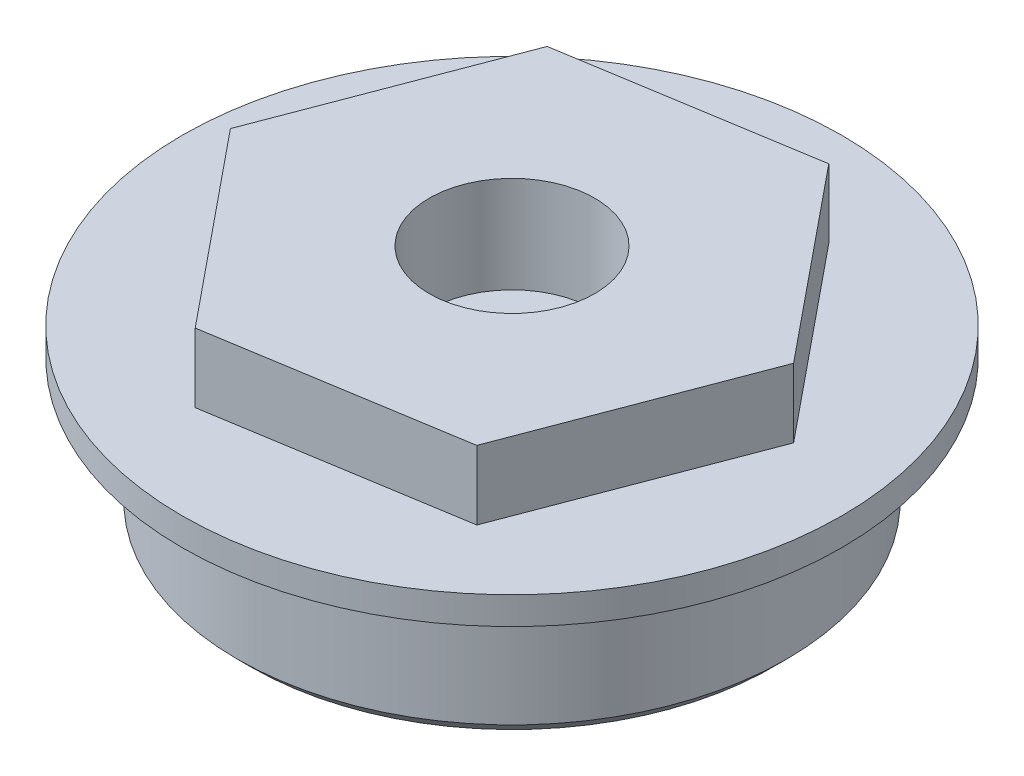
ISO-10303-21;
HEADER;
FILE_DESCRIPTION(('STEP AP214'),'2;1');
FILE_NAME('part.step','',(''),(''),'','','');
FILE_SCHEMA(('AUTOMOTIVE_DESIGN { 1 0 10303 214 1 1 1 1 }'));
ENDSEC;
DATA;
#1=APPLICATION_CONTEXT('core data for automotive mechanical design processes');
#2=APPLICATION_PROTOCOL_DEFINITION('international standard','automotive_design',2000,#1);
#3=PRODUCT_CONTEXT('',#1,'mechanical');
#4=PRODUCT('Part','Part','',(#3));
#5=PRODUCT_RELATED_PRODUCT_CATEGORY('part','',(#4));
#6=PRODUCT_DEFINITION_FORMATION('','',#4);
#7=PRODUCT_DEFINITION_CONTEXT('part definition',#1,'design');
#8=PRODUCT_DEFINITION('design','',#6,#7);
#9=PRODUCT_DEFINITION_SHAPE('','',#8);
#10=(LENGTH_UNIT() NAMED_UNIT(*) SI_UNIT(.MILLI.,.METRE.));
#11=(NAMED_UNIT(*) PLANE_ANGLE_UNIT() SI_UNIT($,.RADIAN.));
#12=(NAMED_UNIT(*) SI_UNIT($,.STERADIAN.) SOLID_ANGLE_UNIT());
#13=UNCERTAINTY_MEASURE_WITH_UNIT(LENGTH_MEASURE(1.E-05),#10,'distance_accuracy_value','');
#14=(GEOMETRIC_REPRESENTATION_CONTEXT(3) GLOBAL_UNCERTAINTY_ASSIGNED_CONTEXT((#13)) GLOBAL_UNIT_ASSIGNED_CONTEXT((#10,
#11,#12)) REPRESENTATION_CONTEXT('',''));
#15=CARTESIAN_POINT('',(0.,0.,0.));
#16=DIRECTION('',(0.,0.,1.));
#17=DIRECTION('',(1.,0.,0.));
#18=AXIS2_PLACEMENT_3D('',#15,#16,#17);
#19=CARTESIAN_POINT('',(0.,8.5,0.));
#20=DIRECTION('',(0.,-1.,0.));
#21=DIRECTION('',(0.,0.,-1.));
#22=AXIS2_PLACEMENT_3D('',#19,#20,#21);
#23=CYLINDRICAL_SURFACE('',#22,1.75);
#24=CARTESIAN_POINT('',(0.,0.,0.));
#25=DIRECTION('',(0.,-1.,0.));
#26=DIRECTION('',(0.,0.,-1.));
#27=AXIS2_PLACEMENT_3D('',#24,#25,#26);
#28=CIRCLE('',#27,1.75);
#29=CARTESIAN_POINT('',(0.,0.,-1.75));
#30=VERTEX_POINT('',#29);
#31=EDGE_CURVE('E143',#30,#30,#28,.T.);
#32=ORIENTED_EDGE('',*,*,#31,.T.);
#33=EDGE_LOOP('',(#32));
#34=FACE_BOUND('',#33,.T.);
#35=CARTESIAN_POINT('',(0.,5.,0.));
#36=DIRECTION('',(0.,1.,0.));
#37=DIRECTION('',(0.,0.,1.));
#38=AXIS2_PLACEMENT_3D('',#35,#36,#37);
#39=CIRCLE('',#38,1.75);
#40=CARTESIAN_POINT('',(0.,5.,1.75));
#41=VERTEX_POINT('',#40);
#42=EDGE_CURVE('E141',#41,#41,#39,.F.);
#43=ORIENTED_EDGE('',*,*,#42,.F.);
#44=EDGE_LOOP('',(#43));
#45=FACE_BOUND('',#44,.T.);
#46=ADVANCED_FACE('F33',(#34,#45),#23,.F.);
#47=CARTESIAN_POINT('',(0.,6.,0.));
#48=DIRECTION('',(0.,1.,0.));
#49=DIRECTION('',(0.,0.,1.));
#50=AXIS2_PLACEMENT_3D('',#47,#48,#49);
#51=PLANE('',#50);
#52=DIRECTION('',(0.987180170449395,0.,-0.159609871472608));
#53=VECTOR('',#52,1.);
#54=CARTESIAN_POINT('',(-3.16273854832839,6.,8.31907956897382));
#55=LINE('',#54,#53);
#56=CARTESIAN_POINT('',(-3.16273854832839,6.,8.31907956897382));
#57=VERTEX_POINT('',#56);
#58=CARTESIAN_POINT('',(5.62316496867123,6.,6.89855171286761));
#59=VERTEX_POINT('',#58);
#60=EDGE_CURVE('E120',#57,#59,#55,.T.);
#61=ORIENTED_EDGE('',*,*,#60,.F.);
#62=DIRECTION('',(0.631816288614745,0.,0.775118169985125));
#63=VECTOR('',#62,1.);
#64=CARTESIAN_POINT('',(-8.78590351699962,6.,1.42052785610621));
#65=LINE('',#64,#63);
#66=CARTESIAN_POINT('',(-8.78590351699962,6.,1.42052785610621));
#67=VERTEX_POINT('',#66);
#68=EDGE_CURVE('E117',#67,#57,#65,.T.);
#69=ORIENTED_EDGE('',*,*,#68,.F.);
#70=DIRECTION('',(-0.35536388183465,0.,0.934728041457733));
#71=VECTOR('',#70,1.);
#72=CARTESIAN_POINT('',(-5.62316496867124,6.,-6.89855171286761));
#73=LINE('',#72,#71);
#74=CARTESIAN_POINT('',(-5.62316496867124,6.,-6.89855171286761));
#75=VERTEX_POINT('',#74);
#76=EDGE_CURVE('E76',#75,#67,#73,.T.);
#77=ORIENTED_EDGE('',*,*,#76,.F.);
#78=DIRECTION('',(-0.987180170449395,0.,0.159609871472608));
#79=VECTOR('',#78,1.);
#80=CARTESIAN_POINT('',(3.16273854832838,6.,-8.31907956897382));
#81=LINE('',#80,#79);
#82=CARTESIAN_POINT('',(3.16273854832838,6.,-8.31907956897382));
#83=VERTEX_POINT('',#82);
#84=EDGE_CURVE('E126',#83,#75,#81,.T.);
#85=ORIENTED_EDGE('',*,*,#84,.F.);
#86=DIRECTION('',(-0.631816288614745,0.,-0.775118169985125));
#87=VECTOR('',#86,1.);
#88=CARTESIAN_POINT('',(8.78590351699962,6.,-1.42052785610621));
#89=LINE('',#88,#87);
#90=CARTESIAN_POINT('',(8.78590351699962,6.,-1.42052785610621));
#91=VERTEX_POINT('',#90);
#92=EDGE_CURVE('E106',#91,#83,#89,.T.);
#93=ORIENTED_EDGE('',*,*,#92,.F.);
#94=DIRECTION('',(0.35536388183465,0.,-0.934728041457733));
#95=VECTOR('',#94,1.);
#96=CARTESIAN_POINT('',(5.62316496867123,6.,6.89855171286761));
#97=LINE('',#96,#95);
#98=EDGE_CURVE('E123',#59,#91,#97,.T.);
#99=ORIENTED_EDGE('',*,*,#98,.F.);
#100=EDGE_LOOP('',(#61,#69,#77,#85,#93,#99));
#101=FACE_BOUND('',#100,.T.);
#102=CARTESIAN_POINT('',(0.,6.,0.));
#103=DIRECTION('',(0.,1.,0.));
#104=DIRECTION('',(0.,0.,1.));
#105=AXIS2_PLACEMENT_3D('',#102,#103,#104);
#106=CIRCLE('',#105,11.95);
#107=CARTESIAN_POINT('',(0.,6.,11.95));
#108=VERTEX_POINT('',#107);
#109=EDGE_CURVE('E416',#108,#108,#106,.T.);
#110=ORIENTED_EDGE('',*,*,#109,.T.);
#111=EDGE_LOOP('',(#110));
#112=FACE_BOUND('',#111,.T.);
#113=ADVANCED_FACE('F162',(#101,#112),#51,.T.);
#114=CARTESIAN_POINT('',(-8.78590351699962,8.5,1.42052785610621));
#115=DIRECTION('',(0.775118169985125,0.,-0.631816288614745));
#116=DIRECTION('',(-0.631816288614745,0.,-0.775118169985125));
#117=AXIS2_PLACEMENT_3D('',#114,#115,#116);
#118=PLANE('',#117);
#119=ORIENTED_EDGE('',*,*,#68,.T.);
#120=DIRECTION('',(0.,-1.,0.));
#121=VECTOR('',#120,1.);
#122=CARTESIAN_POINT('',(-3.16273854832839,8.5,8.31907956897382));
#123=LINE('',#122,#121);
#124=CARTESIAN_POINT('',(-3.16273854832839,8.5,8.31907956897382));
#125=VERTEX_POINT('',#124);
#126=EDGE_CURVE('E136',#125,#57,#123,.T.);
#127=ORIENTED_EDGE('',*,*,#126,.F.);
#128=DIRECTION('',(0.631816288614745,0.,0.775118169985125));
#129=VECTOR('',#128,1.);
#130=CARTESIAN_POINT('',(-8.78590351699962,8.5,1.42052785610621));
#131=LINE('',#130,#129);
#132=CARTESIAN_POINT('',(-8.78590351699962,8.5,1.42052785610621));
#133=VERTEX_POINT('',#132);
#134=EDGE_CURVE('E129',#133,#125,#131,.T.);
#135=ORIENTED_EDGE('',*,*,#134,.F.);
#136=DIRECTION('',(0.,-1.,0.));
#137=VECTOR('',#136,1.);
#138=CARTESIAN_POINT('',(-8.78590351699962,8.5,1.42052785610621));
#139=LINE('',#138,#137);
#140=EDGE_CURVE('E113',#133,#67,#139,.T.);
#141=ORIENTED_EDGE('',*,*,#140,.T.);
#142=EDGE_LOOP('',(#119,#127,#135,#141));
#143=FACE_BOUND('',#142,.T.);
#144=ADVANCED_FACE('F168',(#143),#118,.F.);
#145=CARTESIAN_POINT('',(-3.16273854832839,8.5,8.31907956897382));
#146=DIRECTION('',(-0.159609871472608,0.,-0.987180170449396));
#147=DIRECTION('',(-0.987180170449396,0.,0.159609871472608));
#148=AXIS2_PLACEMENT_3D('',#145,#146,#147);
#149=PLANE('',#148);
#150=ORIENTED_EDGE('',*,*,#60,.T.);
#151=DIRECTION('',(0.,-1.,0.));
#152=VECTOR('',#151,1.);
#153=CARTESIAN_POINT('',(5.62316496867123,8.5,6.89855171286761));
#154=LINE('',#153,#152);
#155=CARTESIAN_POINT('',(5.62316496867123,8.5,6.89855171286761));
#156=VERTEX_POINT('',#155);
#157=EDGE_CURVE('E133',#156,#59,#154,.T.);
#158=ORIENTED_EDGE('',*,*,#157,.F.);
#159=DIRECTION('',(0.987180170449395,0.,-0.159609871472608));
#160=VECTOR('',#159,1.);
#161=CARTESIAN_POINT('',(-3.16273854832839,8.5,8.31907956897382));
#162=LINE('',#161,#160);
#163=EDGE_CURVE('E84',#125,#156,#162,.T.);
#164=ORIENTED_EDGE('',*,*,#163,.F.);
#165=ORIENTED_EDGE('',*,*,#126,.T.);
#166=EDGE_LOOP('',(#150,#158,#164,#165));
#167=FACE_BOUND('',#166,.T.);
#168=ADVANCED_FACE('F229',(#167),#149,.F.);
#169=CARTESIAN_POINT('',(5.62316496867123,8.5,6.89855171286761));
#170=DIRECTION('',(-0.934728041457733,0.,-0.35536388183465));
#171=DIRECTION('',(-0.35536388183465,0.,0.934728041457733));
#172=AXIS2_PLACEMENT_3D('',#169,#170,#171);
#173=PLANE('',#172);
#174=ORIENTED_EDGE('',*,*,#98,.T.);
#175=DIRECTION('',(0.,-1.,0.));
#176=VECTOR('',#175,1.);
#177=CARTESIAN_POINT('',(8.78590351699962,8.5,-1.42052785610621));
#178=LINE('',#177,#176);
#179=CARTESIAN_POINT('',(8.78590351699962,8.5,-1.42052785610621));
#180=VERTEX_POINT('',#179);
#181=EDGE_CURVE('E109',#180,#91,#178,.T.);
#182=ORIENTED_EDGE('',*,*,#181,.F.);
#183=DIRECTION('',(0.35536388183465,0.,-0.934728041457733));
#184=VECTOR('',#183,1.);
#185=CARTESIAN_POINT('',(5.62316496867123,8.5,6.89855171286761));
#186=LINE('',#185,#184);
#187=EDGE_CURVE('E97',#156,#180,#186,.T.);
#188=ORIENTED_EDGE('',*,*,#187,.F.);
#189=ORIENTED_EDGE('',*,*,#157,.T.);
#190=EDGE_LOOP('',(#174,#182,#188,#189));
#191=FACE_BOUND('',#190,.T.);
#192=ADVANCED_FACE('F226',(#191),#173,.F.);
#193=CARTESIAN_POINT('',(8.78590351699962,8.5,-1.42052785610621));
#194=DIRECTION('',(-0.775118169985125,0.,0.631816288614746));
#195=DIRECTION('',(0.631816288614746,0.,0.775118169985125));
#196=AXIS2_PLACEMENT_3D('',#193,#194,#195);
#197=PLANE('',#196);
#198=ORIENTED_EDGE('',*,*,#92,.T.);
#199=DIRECTION('',(0.,-1.,0.));
#200=VECTOR('',#199,1.);
#201=CARTESIAN_POINT('',(3.16273854832838,8.5,-8.31907956897382));
#202=LINE('',#201,#200);
#203=CARTESIAN_POINT('',(3.16273854832838,8.5,-8.31907956897382));
#204=VERTEX_POINT('',#203);
#205=EDGE_CURVE('E103',#204,#83,#202,.T.);
#206=ORIENTED_EDGE('',*,*,#205,.F.);
#207=DIRECTION('',(-0.631816288614745,0.,-0.775118169985125));
#208=VECTOR('',#207,1.);
#209=CARTESIAN_POINT('',(8.78590351699962,8.5,-1.42052785610621));
#210=LINE('',#209,#208);
#211=EDGE_CURVE('E91',#180,#204,#210,.T.);
#212=ORIENTED_EDGE('',*,*,#211,.F.);
#213=ORIENTED_EDGE('',*,*,#181,.T.);
#214=EDGE_LOOP('',(#198,#206,#212,#213));
#215=FACE_BOUND('',#214,.T.);
#216=ADVANCED_FACE('F104',(#215),#197,.F.);
#217=CARTESIAN_POINT('',(3.16273854832838,8.5,-8.31907956897382));
#218=DIRECTION('',(0.159609871472608,0.,0.987180170449396));
#219=DIRECTION('',(0.987180170449396,0.,-0.159609871472608));
#220=AXIS2_PLACEMENT_3D('',#217,#218,#219);
#221=PLANE('',#220);
#222=ORIENTED_EDGE('',*,*,#84,.T.);
#223=DIRECTION('',(0.,-1.,0.));
#224=VECTOR('',#223,1.);
#225=CARTESIAN_POINT('',(-5.62316496867124,8.5,-6.89855171286761));
#226=LINE('',#225,#224);
#227=CARTESIAN_POINT('',(-5.62316496867124,8.5,-6.89855171286761));
#228=VERTEX_POINT('',#227);
#229=EDGE_CURVE('E48',#228,#75,#226,.T.);
#230=ORIENTED_EDGE('',*,*,#229,.F.);
#231=DIRECTION('',(-0.987180170449395,0.,0.159609871472608));
#232=VECTOR('',#231,1.);
#233=CARTESIAN_POINT('',(3.16273854832838,8.5,-8.31907956897382));
#234=LINE('',#233,#232);
#235=EDGE_CURVE('E95',#204,#228,#234,.T.);
#236=ORIENTED_EDGE('',*,*,#235,.F.);
#237=ORIENTED_EDGE('',*,*,#205,.T.);
#238=EDGE_LOOP('',(#222,#230,#236,#237));
#239=FACE_BOUND('',#238,.T.);
#240=ADVANCED_FACE('F111',(#239),#221,.F.);
#241=CARTESIAN_POINT('',(-5.62316496867124,8.5,-6.89855171286761));
#242=DIRECTION('',(0.934728041457733,0.,0.35536388183465));
#243=DIRECTION('',(0.35536388183465,0.,-0.934728041457733));
#244=AXIS2_PLACEMENT_3D('',#241,#242,#243);
#245=PLANE('',#244);
#246=ORIENTED_EDGE('',*,*,#76,.T.);
#247=ORIENTED_EDGE('',*,*,#140,.F.);
#248=DIRECTION('',(-0.35536388183465,0.,0.934728041457733));
#249=VECTOR('',#248,1.);
#250=CARTESIAN_POINT('',(-5.62316496867124,8.5,-6.89855171286761));
#251=LINE('',#250,#249);
#252=EDGE_CURVE('E56',#228,#133,#251,.T.);
#253=ORIENTED_EDGE('',*,*,#252,.F.);
#254=ORIENTED_EDGE('',*,*,#229,.T.);
#255=EDGE_LOOP('',(#246,#247,#253,#254));
#256=FACE_BOUND('',#255,.T.);
#257=ADVANCED_FACE('F218',(#256),#245,.F.);
#258=CARTESIAN_POINT('',(0.,8.5,0.));
#259=DIRECTION('',(0.,1.,0.));
#260=DIRECTION('',(0.,0.,1.));
#261=AXIS2_PLACEMENT_3D('',#258,#259,#260);
#262=PLANE('',#261);
#263=CARTESIAN_POINT('',(0.,8.5,0.));
#264=DIRECTION('',(0.,1.,0.));
#265=DIRECTION('',(0.,0.,1.));
#266=AXIS2_PLACEMENT_3D('',#263,#264,#265);
#267=CIRCLE('',#266,3.);
#268=CARTESIAN_POINT('',(0.,8.5,3.));
#269=VERTEX_POINT('',#268);
#270=EDGE_CURVE('E388',#269,#269,#267,.T.);
#271=ORIENTED_EDGE('',*,*,#270,.F.);
#272=EDGE_LOOP('',(#271));
#273=FACE_BOUND('',#272,.T.);
#274=ORIENTED_EDGE('',*,*,#134,.T.);
#275=ORIENTED_EDGE('',*,*,#163,.T.);
#276=ORIENTED_EDGE('',*,*,#187,.T.);
#277=ORIENTED_EDGE('',*,*,#211,.T.);
#278=ORIENTED_EDGE('',*,*,#235,.T.);
#279=ORIENTED_EDGE('',*,*,#252,.T.);
#280=EDGE_LOOP('',(#274,#275,#276,#277,#278,#279));
#281=FACE_BOUND('',#280,.T.);
#282=ADVANCED_FACE('F93',(#273,#281),#262,.T.);
#283=CARTESIAN_POINT('',(0.,5.,0.));
#284=DIRECTION('',(0.,1.,0.));
#285=DIRECTION('',(0.,0.,1.));
#286=AXIS2_PLACEMENT_3D('',#283,#284,#285);
#287=CYLINDRICAL_SURFACE('',#286,11.95);
#288=CARTESIAN_POINT('',(0.,5.,0.));
#289=DIRECTION('',(0.,1.,0.));
#290=DIRECTION('',(0.,0.,1.));
#291=AXIS2_PLACEMENT_3D('',#288,#289,#290);
#292=CIRCLE('',#291,11.95);
#293=CARTESIAN_POINT('',(0.,5.,11.95));
#294=VERTEX_POINT('',#293);
#295=EDGE_CURVE('E121',#294,#294,#292,.T.);
#296=ORIENTED_EDGE('',*,*,#295,.T.);
#297=EDGE_LOOP('',(#296));
#298=FACE_BOUND('',#297,.T.);
#299=ORIENTED_EDGE('',*,*,#109,.F.);
#300=EDGE_LOOP('',(#299));
#301=FACE_BOUND('',#300,.T.);
#302=ADVANCED_FACE('F211',(#298,#301),#287,.T.);
#303=CARTESIAN_POINT('',(0.,5.,0.));
#304=DIRECTION('',(0.,1.,0.));
#305=DIRECTION('',(0.,0.,1.));
#306=AXIS2_PLACEMENT_3D('',#303,#304,#305);
#307=PLANE('',#306);
#308=CARTESIAN_POINT('',(0.,5.,0.));
#309=DIRECTION('',(0.,1.,0.));
#310=DIRECTION('',(0.,0.,1.));
#311=AXIS2_PLACEMENT_3D('',#308,#309,#310);
#312=CIRCLE('',#311,9.95);
#313=CARTESIAN_POINT('',(0.,5.,9.95));
#314=VERTEX_POINT('',#313);
#315=EDGE_CURVE('E138',#314,#314,#312,.T.);
#316=ORIENTED_EDGE('',*,*,#315,.T.);
#317=EDGE_LOOP('',(#316));
#318=FACE_BOUND('',#317,.T.);
#319=ORIENTED_EDGE('',*,*,#295,.F.);
#320=EDGE_LOOP('',(#319));
#321=FACE_BOUND('',#320,.T.);
#322=ADVANCED_FACE('F207',(#318,#321),#307,.F.);
#323=CARTESIAN_POINT('',(0.,0.,0.));
#324=DIRECTION('',(0.,1.,0.));
#325=DIRECTION('',(0.,0.,1.));
#326=AXIS2_PLACEMENT_3D('',#323,#324,#325);
#327=PLANE('',#326);
#328=CARTESIAN_POINT('',(0.,0.,0.));
#329=DIRECTION('',(0.,1.,0.));
#330=DIRECTION('',(0.,0.,1.));
#331=AXIS2_PLACEMENT_3D('',#328,#329,#330);
#332=CIRCLE('',#331,9.44999999999999);
#333=CARTESIAN_POINT('',(0.,0.,9.44999999999999));
#334=VERTEX_POINT('',#333);
#335=EDGE_CURVE('E11',#334,#334,#332,.F.);
#336=ORIENTED_EDGE('',*,*,#335,.T.);
#337=EDGE_LOOP('',(#336));
#338=FACE_BOUND('',#337,.T.);
#339=ORIENTED_EDGE('',*,*,#31,.F.);
#340=EDGE_LOOP('',(#339));
#341=FACE_BOUND('',#340,.T.);
#342=CARTESIAN_POINT('',(6.00000000000017,0.,1.69795468502936E-13));
#343=DIRECTION('',(0.,-1.,0.));
#344=DIRECTION('',(0.,0.,-1.));
#345=AXIS2_PLACEMENT_3D('',#342,#343,#344);
#346=CIRCLE('',#345,1.50000000000013);
#347=CARTESIAN_POINT('',(6.00000000000017,0.,-1.49999999999996));
#348=VERTEX_POINT('',#347);
#349=EDGE_CURVE('E399',#348,#348,#346,.T.);
#350=ORIENTED_EDGE('',*,*,#349,.F.);
#351=EDGE_LOOP('',(#350));
#352=FACE_BOUND('',#351,.T.);
#353=CARTESIAN_POINT('',(3.39590937005871E-13,0.,-6.));
#354=DIRECTION('',(0.,-1.,0.));
#355=DIRECTION('',(0.,0.,-1.));
#356=AXIS2_PLACEMENT_3D('',#353,#354,#355);
#357=CIRCLE('',#356,1.50000000000037);
#358=CARTESIAN_POINT('',(3.39590937005871E-13,0.,-7.50000000000037));
#359=VERTEX_POINT('',#358);
#360=EDGE_CURVE('E405',#359,#359,#357,.T.);
#361=ORIENTED_EDGE('',*,*,#360,.F.);
#362=EDGE_LOOP('',(#361));
#363=FACE_BOUND('',#362,.T.);
#364=CARTESIAN_POINT('',(-5.99999999999983,0.,-1.70530256582424E-13));
#365=DIRECTION('',(0.,-1.,0.));
#366=DIRECTION('',(0.,0.,-1.));
#367=AXIS2_PLACEMENT_3D('',#364,#365,#366);
#368=CIRCLE('',#367,1.50000000000027);
#369=CARTESIAN_POINT('',(-5.99999999999983,0.,-1.50000000000044));
#370=VERTEX_POINT('',#369);
#371=EDGE_CURVE('E394',#370,#370,#368,.T.);
#372=ORIENTED_EDGE('',*,*,#371,.F.);
#373=EDGE_LOOP('',(#372));
#374=FACE_BOUND('',#373,.T.);
#375=CARTESIAN_POINT('',(0.,0.,6.));
#376=DIRECTION('',(0.,-1.,0.));
#377=DIRECTION('',(0.,0.,-1.));
#378=AXIS2_PLACEMENT_3D('',#375,#376,#377);
#379=CIRCLE('',#378,1.5);
#380=CARTESIAN_POINT('',(0.,0.,4.5));
#381=VERTEX_POINT('',#380);
#382=EDGE_CURVE('E398',#381,#381,#379,.T.);
#383=ORIENTED_EDGE('',*,*,#382,.F.);
#384=EDGE_LOOP('',(#383));
#385=FACE_BOUND('',#384,.T.);
#386=ADVANCED_FACE('F210',(#338,#341,#352,#363,#374,#385),#327,.F.);
#387=CARTESIAN_POINT('',(0.,6.,0.));
#388=DIRECTION('',(0.,-1.,0.));
#389=DIRECTION('',(0.,0.,-1.));
#390=AXIS2_PLACEMENT_3D('',#387,#388,#389);
#391=CYLINDRICAL_SURFACE('',#390,9.95);
#392=CARTESIAN_POINT('',(0.,0.500000000000002,0.));
#393=DIRECTION('',(0.,1.,0.));
#394=DIRECTION('',(0.,0.,1.));
#395=AXIS2_PLACEMENT_3D('',#392,#393,#394);
#396=CIRCLE('',#395,9.95);
#397=CARTESIAN_POINT('',(0.,0.500000000000002,9.95));
#398=VERTEX_POINT('',#397);
#399=EDGE_CURVE('E41',#398,#398,#396,.T.);
#400=ORIENTED_EDGE('',*,*,#399,.T.);
#401=EDGE_LOOP('',(#400));
#402=FACE_BOUND('',#401,.T.);
#403=ORIENTED_EDGE('',*,*,#315,.F.);
#404=EDGE_LOOP('',(#403));
#405=FACE_BOUND('',#404,.T.);
#406=ADVANCED_FACE('F148',(#402,#405),#391,.T.);
#407=CARTESIAN_POINT('',(0.,5.,6.));
#408=DIRECTION('',(0.,-1.,0.));
#409=DIRECTION('',(0.,0.,-1.));
#410=AXIS2_PLACEMENT_3D('',#407,#408,#409);
#411=CYLINDRICAL_SURFACE('',#410,1.5);
#412=CARTESIAN_POINT('',(0.,5.,6.));
#413=DIRECTION('',(0.,-1.,0.));
#414=DIRECTION('',(0.,0.,-1.));
#415=AXIS2_PLACEMENT_3D('',#412,#413,#414);
#416=CIRCLE('',#415,1.5);
#417=CARTESIAN_POINT('',(0.,5.,4.5));
#418=VERTEX_POINT('',#417);
#419=EDGE_CURVE('E413',#418,#418,#416,.T.);
#420=ORIENTED_EDGE('',*,*,#419,.F.);
#421=EDGE_LOOP('',(#420));
#422=FACE_BOUND('',#421,.T.);
#423=ORIENTED_EDGE('',*,*,#382,.T.);
#424=EDGE_LOOP('',(#423));
#425=FACE_BOUND('',#424,.T.);
#426=ADVANCED_FACE('F202',(#422,#425),#411,.F.);
#427=CARTESIAN_POINT('',(0.,5.,6.));
#428=DIRECTION('',(0.,-1.,0.));
#429=DIRECTION('',(0.,0.,-1.));
#430=AXIS2_PLACEMENT_3D('',#427,#428,#429);
#431=PLANE('',#430);
#432=ORIENTED_EDGE('',*,*,#419,.T.);
#433=EDGE_LOOP('',(#432));
#434=FACE_BOUND('',#433,.T.);
#435=ADVANCED_FACE('F198',(#434),#431,.T.);
#436=CARTESIAN_POINT('',(-5.99999999999983,5.,-1.70530256582424E-13));
#437=DIRECTION('',(0.,-1.,0.));
#438=DIRECTION('',(0.,0.,-1.));
#439=AXIS2_PLACEMENT_3D('',#436,#437,#438);
#440=CYLINDRICAL_SURFACE('',#439,1.50000000000027);
#441=CARTESIAN_POINT('',(-5.99999999999983,5.,-1.70530256582424E-13));
#442=DIRECTION('',(0.,-1.,0.));
#443=DIRECTION('',(0.,0.,-1.));
#444=AXIS2_PLACEMENT_3D('',#441,#442,#443);
#445=CIRCLE('',#444,1.50000000000027);
#446=CARTESIAN_POINT('',(-5.99999999999983,5.,-1.50000000000044));
#447=VERTEX_POINT('',#446);
#448=EDGE_CURVE('E408',#447,#447,#445,.T.);
#449=ORIENTED_EDGE('',*,*,#448,.F.);
#450=EDGE_LOOP('',(#449));
#451=FACE_BOUND('',#450,.T.);
#452=ORIENTED_EDGE('',*,*,#371,.T.);
#453=EDGE_LOOP('',(#452));
#454=FACE_BOUND('',#453,.T.);
#455=ADVANCED_FACE('F194',(#451,#454),#440,.F.);
#456=CARTESIAN_POINT('',(-5.99999999999983,5.,-1.70530256582424E-13));
#457=DIRECTION('',(0.,-1.,0.));
#458=DIRECTION('',(0.,0.,-1.));
#459=AXIS2_PLACEMENT_3D('',#456,#457,#458);
#460=PLANE('',#459);
#461=ORIENTED_EDGE('',*,*,#448,.T.);
#462=EDGE_LOOP('',(#461));
#463=FACE_BOUND('',#462,.T.);
#464=ADVANCED_FACE('F190',(#463),#460,.T.);
#465=CARTESIAN_POINT('',(3.39590937005871E-13,5.,-6.));
#466=DIRECTION('',(0.,-1.,0.));
#467=DIRECTION('',(0.,0.,-1.));
#468=AXIS2_PLACEMENT_3D('',#465,#466,#467);
#469=CYLINDRICAL_SURFACE('',#468,1.50000000000037);
#470=CARTESIAN_POINT('',(3.39590937005871E-13,5.,-6.));
#471=DIRECTION('',(0.,-1.,0.));
#472=DIRECTION('',(0.,0.,-1.));
#473=AXIS2_PLACEMENT_3D('',#470,#471,#472);
#474=CIRCLE('',#473,1.50000000000037);
#475=CARTESIAN_POINT('',(3.39590937005871E-13,5.,-7.50000000000037));
#476=VERTEX_POINT('',#475);
#477=EDGE_CURVE('E402',#476,#476,#474,.T.);
#478=ORIENTED_EDGE('',*,*,#477,.F.);
#479=EDGE_LOOP('',(#478));
#480=FACE_BOUND('',#479,.T.);
#481=ORIENTED_EDGE('',*,*,#360,.T.);
#482=EDGE_LOOP('',(#481));
#483=FACE_BOUND('',#482,.T.);
#484=ADVANCED_FACE('F186',(#480,#483),#469,.F.);
#485=CARTESIAN_POINT('',(3.39590937005871E-13,5.,-6.));
#486=DIRECTION('',(0.,-1.,0.));
#487=DIRECTION('',(0.,0.,-1.));
#488=AXIS2_PLACEMENT_3D('',#485,#486,#487);
#489=PLANE('',#488);
#490=ORIENTED_EDGE('',*,*,#477,.T.);
#491=EDGE_LOOP('',(#490));
#492=FACE_BOUND('',#491,.T.);
#493=ADVANCED_FACE('F182',(#492),#489,.T.);
#494=CARTESIAN_POINT('',(6.00000000000017,5.,1.69795468502936E-13));
#495=DIRECTION('',(0.,-1.,0.));
#496=DIRECTION('',(0.,0.,-1.));
#497=AXIS2_PLACEMENT_3D('',#494,#495,#496);
#498=CYLINDRICAL_SURFACE('',#497,1.50000000000013);
#499=CARTESIAN_POINT('',(6.00000000000017,5.,1.69795468502936E-13));
#500=DIRECTION('',(0.,-1.,0.));
#501=DIRECTION('',(0.,0.,-1.));
#502=AXIS2_PLACEMENT_3D('',#499,#500,#501);
#503=CIRCLE('',#502,1.50000000000013);
#504=CARTESIAN_POINT('',(6.00000000000017,5.,-1.49999999999996));
#505=VERTEX_POINT('',#504);
#506=EDGE_CURVE('E395',#505,#505,#503,.T.);
#507=ORIENTED_EDGE('',*,*,#506,.F.);
#508=EDGE_LOOP('',(#507));
#509=FACE_BOUND('',#508,.T.);
#510=ORIENTED_EDGE('',*,*,#349,.T.);
#511=EDGE_LOOP('',(#510));
#512=FACE_BOUND('',#511,.T.);
#513=ADVANCED_FACE('F178',(#509,#512),#498,.F.);
#514=CARTESIAN_POINT('',(6.00000000000017,5.,1.69795468502936E-13));
#515=DIRECTION('',(0.,-1.,0.));
#516=DIRECTION('',(0.,0.,-1.));
#517=AXIS2_PLACEMENT_3D('',#514,#515,#516);
#518=PLANE('',#517);
#519=ORIENTED_EDGE('',*,*,#506,.T.);
#520=EDGE_LOOP('',(#519));
#521=FACE_BOUND('',#520,.T.);
#522=ADVANCED_FACE('F175',(#521),#518,.T.);
#523=CARTESIAN_POINT('',(0.,5.,0.));
#524=DIRECTION('',(0.,1.,0.));
#525=DIRECTION('',(0.,0.,1.));
#526=AXIS2_PLACEMENT_3D('',#523,#524,#525);
#527=PLANE('',#526);
#528=CARTESIAN_POINT('',(0.,5.,0.));
#529=DIRECTION('',(0.,1.,0.));
#530=DIRECTION('',(0.,0.,1.));
#531=AXIS2_PLACEMENT_3D('',#528,#529,#530);
#532=CIRCLE('',#531,3.);
#533=CARTESIAN_POINT('',(0.,5.,3.));
#534=VERTEX_POINT('',#533);
#535=EDGE_CURVE('E144',#534,#534,#532,.T.);
#536=ORIENTED_EDGE('',*,*,#535,.T.);
#537=EDGE_LOOP('',(#536));
#538=FACE_BOUND('',#537,.T.);
#539=ORIENTED_EDGE('',*,*,#42,.T.);
#540=EDGE_LOOP('',(#539));
#541=FACE_BOUND('',#540,.T.);
#542=ADVANCED_FACE('F157',(#538,#541),#527,.T.);
#543=CARTESIAN_POINT('',(0.,5.,0.));
#544=DIRECTION('',(0.,1.,0.));
#545=DIRECTION('',(0.,0.,1.));
#546=AXIS2_PLACEMENT_3D('',#543,#544,#545);
#547=CYLINDRICAL_SURFACE('',#546,3.);
#548=ORIENTED_EDGE('',*,*,#535,.F.);
#549=EDGE_LOOP('',(#548));
#550=FACE_BOUND('',#549,.T.);
#551=ORIENTED_EDGE('',*,*,#270,.T.);
#552=EDGE_LOOP('',(#551));
#553=FACE_BOUND('',#552,.T.);
#554=ADVANCED_FACE('F152',(#550,#553),#547,.F.);
#555=CARTESIAN_POINT('',(0.,0.500000000000002,0.));
#556=DIRECTION('',(0.,1.,0.));
#557=DIRECTION('',(0.,0.,1.));
#558=AXIS2_PLACEMENT_3D('',#555,#556,#557);
#559=CONICAL_SURFACE('',#558,9.95,0.785398163397452);
#560=ORIENTED_EDGE('',*,*,#335,.F.);
#561=EDGE_LOOP('',(#560));
#562=FACE_BOUND('',#561,.T.);
#563=ORIENTED_EDGE('',*,*,#399,.F.);
#564=EDGE_LOOP('',(#563));
#565=FACE_BOUND('',#564,.T.);
#566=ADVANCED_FACE('F35',(#562,#565),#559,.T.);
#567=CLOSED_SHELL('',(#46,#113,#144,#168,#192,#216,#240,#257,#282,#302,#322,#386,#406,#426,#435,
#455,#464,#484,#493,#513,#522,#542,#554,#566));
#568=MANIFOLD_SOLID_BREP('B2',#567);
#569=ADVANCED_BREP_SHAPE_REPRESENTATION('',(#18,#568),#14);
#570=SHAPE_DEFINITION_REPRESENTATION(#9,#569);
ENDSEC;
END-ISO-10303-21;
